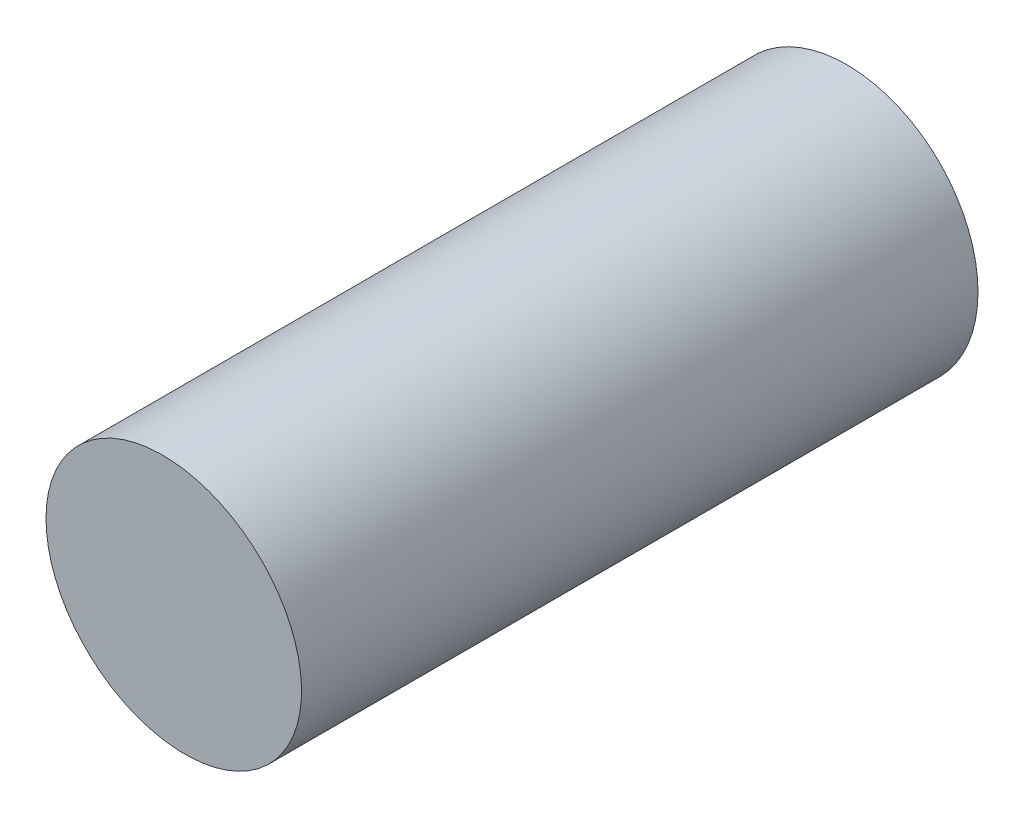
ISO-10303-21;
HEADER;
FILE_DESCRIPTION(('STEP AP214'),'2;1');
FILE_NAME('part.step','',(''),(''),'','','');
FILE_SCHEMA(('AUTOMOTIVE_DESIGN { 1 0 10303 214 1 1 1 1 }'));
ENDSEC;
DATA;
#1=APPLICATION_CONTEXT('core data for automotive mechanical design processes');
#2=APPLICATION_PROTOCOL_DEFINITION('international standard','automotive_design',2000,#1);
#3=PRODUCT_CONTEXT('',#1,'mechanical');
#4=PRODUCT('Part','Part','',(#3));
#5=PRODUCT_RELATED_PRODUCT_CATEGORY('part','',(#4));
#6=PRODUCT_DEFINITION_FORMATION('','',#4);
#7=PRODUCT_DEFINITION_CONTEXT('part definition',#1,'design');
#8=PRODUCT_DEFINITION('design','',#6,#7);
#9=PRODUCT_DEFINITION_SHAPE('','',#8);
#10=(LENGTH_UNIT() NAMED_UNIT(*) SI_UNIT(.MILLI.,.METRE.));
#11=(NAMED_UNIT(*) PLANE_ANGLE_UNIT() SI_UNIT($,.RADIAN.));
#12=(NAMED_UNIT(*) SI_UNIT($,.STERADIAN.) SOLID_ANGLE_UNIT());
#13=UNCERTAINTY_MEASURE_WITH_UNIT(LENGTH_MEASURE(1.E-05),#10,'distance_accuracy_value','');
#14=(GEOMETRIC_REPRESENTATION_CONTEXT(3) GLOBAL_UNCERTAINTY_ASSIGNED_CONTEXT((#13)) GLOBAL_UNIT_ASSIGNED_CONTEXT((#10,
#11,#12)) REPRESENTATION_CONTEXT('',''));
#15=CARTESIAN_POINT('',(0.,0.,0.));
#16=DIRECTION('',(0.,0.,1.));
#17=DIRECTION('',(1.,0.,0.));
#18=AXIS2_PLACEMENT_3D('',#15,#16,#17);
#19=CARTESIAN_POINT('',(-18.4719129100541,0.,7.91333750369345));
#20=DIRECTION('',(0.,0.,-1.));
#21=DIRECTION('',(-1.,0.,0.));
#22=AXIS2_PLACEMENT_3D('',#19,#20,#21);
#23=CYLINDRICAL_SURFACE('',#22,1.);
#24=CARTESIAN_POINT('',(-18.4719129100541,0.,5.08215093522603));
#25=DIRECTION('',(0.0279512950365802,0.055765362810907,-0.99805257848289));
#26=DIRECTION('',(-0.447220720585489,-0.89224580497492,-0.0623782861551521));
#27=AXIS2_PLACEMENT_3D('',#24,#25,#26);
#28=ELLIPSE('',#27,1.00195122136759,1.);
#29=CARTESIAN_POINT('',(-18.9200062572656,-0.893986774054727,5.01965093522606));
#30=VERTEX_POINT('',#29);
#31=EDGE_CURVE('E10',#30,#30,#28,.T.);
#32=ORIENTED_EDGE('',*,*,#31,.T.);
#33=EDGE_LOOP('',(#32));
#34=FACE_BOUND('',#33,.T.);
#35=CARTESIAN_POINT('',(-18.4719129100541,0.,-0.0459882398410119));
#36=DIRECTION('',(0.,0.,1.));
#37=DIRECTION('',(1.,0.,0.));
#38=AXIS2_PLACEMENT_3D('',#35,#36,#37);
#39=CIRCLE('',#38,1.);
#40=CARTESIAN_POINT('',(-17.4719129100541,0.,-0.0459882398410119));
#41=VERTEX_POINT('',#40);
#42=EDGE_CURVE('E37',#41,#41,#39,.F.);
#43=ORIENTED_EDGE('',*,*,#42,.F.);
#44=EDGE_LOOP('',(#43));
#45=FACE_BOUND('',#44,.T.);
#46=ADVANCED_FACE('F31',(#34,#45),#23,.T.);
#47=CARTESIAN_POINT('',(-22.0629927270563,19.6562374503542,6.07985576853755));
#48=DIRECTION('',(0.0279512950365802,0.055765362810907,-0.99805257848289));
#49=DIRECTION('',(-0.4472207205863,-0.892245804974513,-0.0623782861551521));
#50=AXIS2_PLACEMENT_3D('',#47,#48,#49);
#51=PLANE('',#50);
#52=ORIENTED_EDGE('',*,*,#31,.F.);
#53=EDGE_LOOP('',(#52));
#54=FACE_BOUND('',#53,.T.);
#55=ADVANCED_FACE('F46',(#54),#51,.F.);
#56=CARTESIAN_POINT('',(-26.3206109776935,11.1619037836712,-0.0459882398410119));
#57=DIRECTION('',(0.,0.,1.));
#58=DIRECTION('',(0.893986774054318,-0.448093347212335,0.));
#59=AXIS2_PLACEMENT_3D('',#56,#57,#58);
#60=PLANE('',#59);
#61=ORIENTED_EDGE('',*,*,#42,.T.);
#62=EDGE_LOOP('',(#61));
#63=FACE_BOUND('',#62,.T.);
#64=ADVANCED_FACE('F43',(#63),#60,.F.);
#65=CLOSED_SHELL('',(#46,#55,#64));
#66=MANIFOLD_SOLID_BREP('B2',#65);
#67=ADVANCED_BREP_SHAPE_REPRESENTATION('',(#18,#66),#14);
#68=SHAPE_DEFINITION_REPRESENTATION(#9,#67);
ENDSEC;
END-ISO-10303-21;
